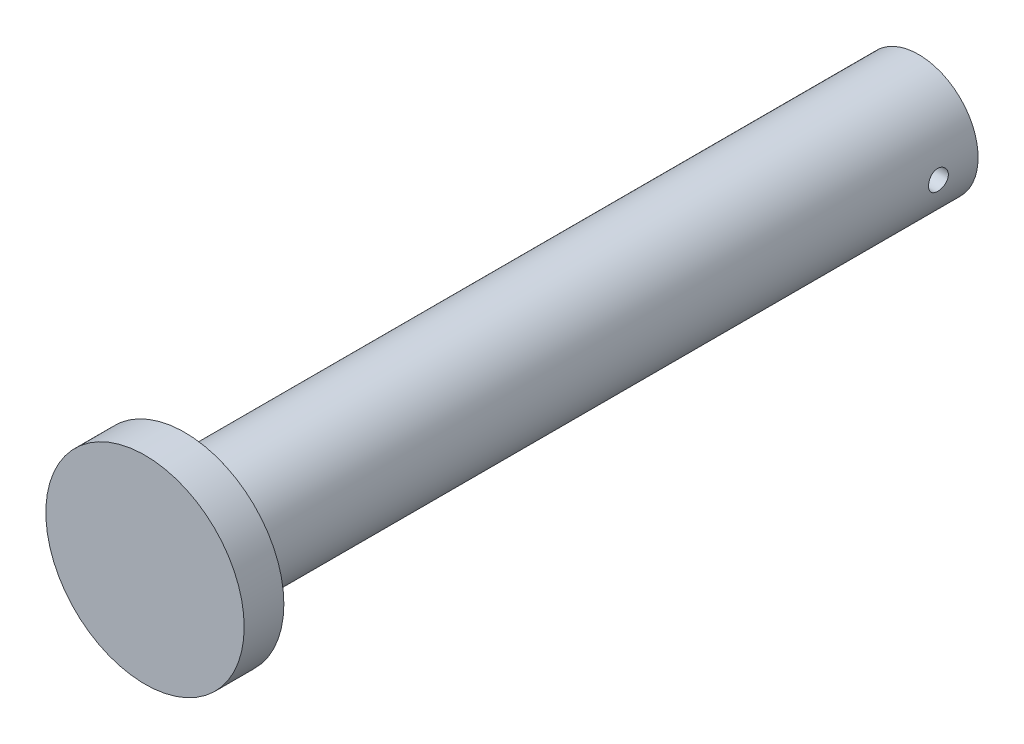
ISO-10303-21;
HEADER;
FILE_DESCRIPTION(('STEP AP214'),'2;1');
FILE_NAME('part.step','',(''),(''),'','','');
FILE_SCHEMA(('AUTOMOTIVE_DESIGN { 1 0 10303 214 1 1 1 1 }'));
ENDSEC;
DATA;
#1=APPLICATION_CONTEXT('core data for automotive mechanical design processes');
#2=APPLICATION_PROTOCOL_DEFINITION('international standard','automotive_design',2000,#1);
#3=PRODUCT_CONTEXT('',#1,'mechanical');
#4=PRODUCT('Part','Part','',(#3));
#5=PRODUCT_RELATED_PRODUCT_CATEGORY('part','',(#4));
#6=PRODUCT_DEFINITION_FORMATION('','',#4);
#7=PRODUCT_DEFINITION_CONTEXT('part definition',#1,'design');
#8=PRODUCT_DEFINITION('design','',#6,#7);
#9=PRODUCT_DEFINITION_SHAPE('','',#8);
#10=(LENGTH_UNIT() NAMED_UNIT(*) SI_UNIT(.MILLI.,.METRE.));
#11=(NAMED_UNIT(*) PLANE_ANGLE_UNIT() SI_UNIT($,.RADIAN.));
#12=(NAMED_UNIT(*) SI_UNIT($,.STERADIAN.) SOLID_ANGLE_UNIT());
#13=UNCERTAINTY_MEASURE_WITH_UNIT(LENGTH_MEASURE(1.E-05),#10,'distance_accuracy_value','');
#14=(GEOMETRIC_REPRESENTATION_CONTEXT(3) GLOBAL_UNCERTAINTY_ASSIGNED_CONTEXT((#13)) GLOBAL_UNIT_ASSIGNED_CONTEXT((#10,
#11,#12)) REPRESENTATION_CONTEXT('',''));
#15=CARTESIAN_POINT('',(0.,0.,0.));
#16=DIRECTION('',(0.,0.,1.));
#17=DIRECTION('',(1.,0.,0.));
#18=AXIS2_PLACEMENT_3D('',#15,#16,#17);
#19=CARTESIAN_POINT('',(0.,0.,10.));
#20=DIRECTION('',(0.,0.,-1.));
#21=DIRECTION('',(-1.,0.,0.));
#22=AXIS2_PLACEMENT_3D('',#19,#20,#21);
#23=CYLINDRICAL_SURFACE('',#22,25.);
#24=CARTESIAN_POINT('',(0.,0.,10.));
#25=DIRECTION('',(0.,0.,1.));
#26=DIRECTION('',(1.,0.,0.));
#27=AXIS2_PLACEMENT_3D('',#24,#25,#26);
#28=CIRCLE('',#27,25.);
#29=CARTESIAN_POINT('',(25.,0.,10.));
#30=VERTEX_POINT('',#29);
#31=EDGE_CURVE('E43',#30,#30,#28,.T.);
#32=ORIENTED_EDGE('',*,*,#31,.F.);
#33=EDGE_LOOP('',(#32));
#34=FACE_BOUND('',#33,.T.);
#35=CARTESIAN_POINT('',(0.,0.,0.));
#36=DIRECTION('',(0.,0.,1.));
#37=DIRECTION('',(1.,0.,0.));
#38=AXIS2_PLACEMENT_3D('',#35,#36,#37);
#39=CIRCLE('',#38,25.);
#40=CARTESIAN_POINT('',(25.,0.,0.));
#41=VERTEX_POINT('',#40);
#42=EDGE_CURVE('E48',#41,#41,#39,.T.);
#43=ORIENTED_EDGE('',*,*,#42,.T.);
#44=EDGE_LOOP('',(#43));
#45=FACE_BOUND('',#44,.T.);
#46=ADVANCED_FACE('F31',(#34,#45),#23,.T.);
#47=CARTESIAN_POINT('',(0.,0.,10.));
#48=DIRECTION('',(0.,0.,1.));
#49=DIRECTION('',(1.,0.,0.));
#50=AXIS2_PLACEMENT_3D('',#47,#48,#49);
#51=PLANE('',#50);
#52=ORIENTED_EDGE('',*,*,#31,.T.);
#53=EDGE_LOOP('',(#52));
#54=FACE_BOUND('',#53,.T.);
#55=ADVANCED_FACE('F78',(#54),#51,.T.);
#56=CARTESIAN_POINT('',(0.,0.,0.));
#57=DIRECTION('',(0.,0.,1.));
#58=DIRECTION('',(1.,0.,0.));
#59=AXIS2_PLACEMENT_3D('',#56,#57,#58);
#60=PLANE('',#59);
#61=CARTESIAN_POINT('',(0.,0.,0.));
#62=DIRECTION('',(0.,0.,-1.));
#63=DIRECTION('',(-1.,0.,0.));
#64=AXIS2_PLACEMENT_3D('',#61,#62,#63);
#65=CIRCLE('',#64,15.);
#66=CARTESIAN_POINT('',(-15.,0.,0.));
#67=VERTEX_POINT('',#66);
#68=EDGE_CURVE('E10',#67,#67,#65,.T.);
#69=ORIENTED_EDGE('',*,*,#68,.F.);
#70=EDGE_LOOP('',(#69));
#71=FACE_BOUND('',#70,.T.);
#72=ORIENTED_EDGE('',*,*,#42,.F.);
#73=EDGE_LOOP('',(#72));
#74=FACE_BOUND('',#73,.T.);
#75=ADVANCED_FACE('F74',(#71,#74),#60,.F.);
#76=CARTESIAN_POINT('',(0.,0.,-185.));
#77=DIRECTION('',(0.,0.,1.));
#78=DIRECTION('',(1.,0.,0.));
#79=AXIS2_PLACEMENT_3D('',#76,#77,#78);
#80=CYLINDRICAL_SURFACE('',#79,15.);
#81=CARTESIAN_POINT('',(15.,0.,-177.5));
#82=CARTESIAN_POINT('',(14.9999976116882,-0.139390904958215,-177.499994411052));
#83=CARTESIAN_POINT('',(14.9980367791303,-0.27885788183882,-177.488302725031));
#84=CARTESIAN_POINT('',(14.9904034494139,-0.553880221673042,-177.441864341235));
#85=CARTESIAN_POINT('',(14.9847275392389,-0.689431867959246,-177.407096443088));
#86=CARTESIAN_POINT('',(14.9703006823645,-0.952604747212646,-177.315584551407));
#87=CARTESIAN_POINT('',(14.9615522515919,-1.0802323684319,-177.258858534359));
#88=CARTESIAN_POINT('',(14.9419422708207,-1.32414184197795,-177.125087707948));
#89=CARTESIAN_POINT('',(14.9310809625443,-1.44042498987859,-177.048045222517));
#90=CARTESIAN_POINT('',(14.9083331745831,-1.65947261429168,-176.87504491618));
#91=CARTESIAN_POINT('',(14.8964387181486,-1.76211290353497,-176.778930885364));
#92=CARTESIAN_POINT('',(14.8730262687673,-1.94988849865993,-176.570852031527));
#93=CARTESIAN_POINT('',(14.8615082996267,-2.03502269939097,-176.458886208543));
#94=CARTESIAN_POINT('',(14.8400756575978,-2.18586712560513,-176.221429033803));
#95=CARTESIAN_POINT('',(14.8301712909164,-2.251454552861,-176.095858663195));
#96=CARTESIAN_POINT('',(14.8131978979467,-2.36055836541122,-175.835290435699));
#97=CARTESIAN_POINT('',(14.8061286801431,-2.40407624156561,-175.700293216322));
#98=CARTESIAN_POINT('',(14.7957053684276,-2.4674143777848,-175.426019725143));
#99=CARTESIAN_POINT('',(14.792317684857,-2.4874490291354,-175.286794263499));
#100=CARTESIAN_POINT('',(14.7895393893665,-2.50391672528987,-175.006919723116));
#101=CARTESIAN_POINT('',(14.7901484945721,-2.50035144038899,-174.866270745833));
#102=CARTESIAN_POINT('',(14.7952642886356,-2.46989509839614,-174.589072138725));
#103=CARTESIAN_POINT('',(14.7997307331892,-2.44324488188976,-174.452495196455));
#104=CARTESIAN_POINT('',(14.8119949521101,-2.36775314040344,-174.185778682171));
#105=CARTESIAN_POINT('',(14.8197928407327,-2.31891085431974,-174.055639331111));
#106=CARTESIAN_POINT('',(14.837884793341,-2.20017724609391,-173.804771176559));
#107=CARTESIAN_POINT('',(14.8481906710733,-2.1301859138797,-173.684090593919));
#108=CARTESIAN_POINT('',(14.8701291841501,-1.97121201755742,-173.456095599462));
#109=CARTESIAN_POINT('',(14.8817619265429,-1.88222792065428,-173.348782267545));
#110=CARTESIAN_POINT('',(14.9052202787979,-1.68648221215905,-173.149173914193));
#111=CARTESIAN_POINT('',(14.9170464923165,-1.57951396387313,-173.05708148146));
#112=CARTESIAN_POINT('',(14.9394260139672,-1.35153524898166,-172.892122237335));
#113=CARTESIAN_POINT('',(14.9499793138974,-1.23052469190643,-172.819255549817));
#114=CARTESIAN_POINT('',(14.9686389289291,-0.977705916166724,-172.694797772864));
#115=CARTESIAN_POINT('',(14.9767431840745,-0.845888725564671,-172.643224580669));
#116=CARTESIAN_POINT('',(14.9895750301266,-0.575298345602738,-172.563005784754));
#117=CARTESIAN_POINT('',(14.9943029035047,-0.436525739179473,-172.534358263026));
#118=CARTESIAN_POINT('',(14.9998112984269,-0.157709901301627,-172.501078641539));
#119=CARTESIAN_POINT('',(15.0006375301278,-0.017700737151013,-172.496168428194));
#120=CARTESIAN_POINT('',(14.9983747442117,0.261139772889888,-172.509761344428));
#121=CARTESIAN_POINT('',(14.9952858772412,0.39997116389204,-172.528263573134));
#122=CARTESIAN_POINT('',(14.985568269382,0.671656175546766,-172.587924849336));
#123=CARTESIAN_POINT('',(14.9789610480131,0.804540868385382,-172.62894620839));
#124=CARTESIAN_POINT('',(14.9629446445536,1.06154688486045,-172.7323345182));
#125=CARTESIAN_POINT('',(14.9535353051202,1.18566771590972,-172.794702667635));
#126=CARTESIAN_POINT('',(14.9328451630241,1.42283068946896,-172.939651124697));
#127=CARTESIAN_POINT('',(14.9215485588702,1.53576525093714,-173.022405156167));
#128=CARTESIAN_POINT('',(14.898384673919,1.74624358550268,-173.205537315385));
#129=CARTESIAN_POINT('',(14.8865173517155,1.84378623969658,-173.305916723277));
#130=CARTESIAN_POINT('',(14.8634017523585,2.021742779658,-173.522697548071));
#131=CARTESIAN_POINT('',(14.8521611613711,2.10196876111372,-173.639254165514));
#132=CARTESIAN_POINT('',(14.8317152977788,2.24170231029499,-173.884352969139));
#133=CARTESIAN_POINT('',(14.8225099606602,2.30121053476982,-174.012894775227));
#134=CARTESIAN_POINT('',(14.807234536977,2.39753833147315,-174.277789732812));
#135=CARTESIAN_POINT('',(14.8011515431106,2.43445143254794,-174.41410809503));
#136=CARTESIAN_POINT('',(14.7927771683526,2.48483545377827,-174.691120129222));
#137=CARTESIAN_POINT('',(14.7904854578272,2.49830841194616,-174.831813419732));
#138=CARTESIAN_POINT('',(14.7899673308401,2.50137286604735,-175.111705165962));
#139=CARTESIAN_POINT('',(14.7916905650565,2.49126013612518,-175.250900378575));
#140=CARTESIAN_POINT('',(14.7988978145373,2.44807983895684,-175.525579248051));
#141=CARTESIAN_POINT('',(14.8043818176121,2.41501234611247,-175.661062916942));
#142=CARTESIAN_POINT('',(14.8184735628172,2.32697448959489,-175.924358437293));
#143=CARTESIAN_POINT('',(14.8270776721967,2.27202959060043,-176.052179010056));
#144=CARTESIAN_POINT('',(14.8464436892221,2.14182700391589,-176.296835669195));
#145=CARTESIAN_POINT('',(14.857205703884,2.06656830874855,-176.413671210372));
#146=CARTESIAN_POINT('',(14.8798345404562,1.89681888437215,-176.634535583108));
#147=CARTESIAN_POINT('',(14.891712955763,1.80211056359364,-176.7383960167));
#148=CARTESIAN_POINT('',(14.9151437236084,1.59660903138023,-176.928851604475));
#149=CARTESIAN_POINT('',(14.9266960002655,1.48581211291264,-177.015442768638));
#150=CARTESIAN_POINT('',(14.9482652964222,1.25036916964029,-177.1694482682));
#151=CARTESIAN_POINT('',(14.958271162531,1.12563278753283,-177.236726039313));
#152=CARTESIAN_POINT('',(14.9755116760178,0.866513069378989,-177.34926948461));
#153=CARTESIAN_POINT('',(14.9827490817748,0.732139494830016,-177.39455708108));
#154=CARTESIAN_POINT('',(14.9920579083296,0.497703310045405,-177.452005274127));
#155=CARTESIAN_POINT('',(14.9950202727336,0.399058830298451,-177.469974469616));
#156=CARTESIAN_POINT('',(14.9989921598612,0.200289310319811,-177.493973737845));
#157=CARTESIAN_POINT('',(15.0000017162064,0.100164295608495,-177.500004016137));
#158=CARTESIAN_POINT('',(15.,0.,-177.5));
#159=B_SPLINE_CURVE_WITH_KNOTS('',3,(#81,#82,#83,#84,#85,#86,#87,#88,#89,#90,#91,#92,#93,#94,
#95,#96,#97,#98,#99,#100,#101,#102,#103,#104,#105,#106,#107,#108,#109,#110,#111,#112,#113,#114,
#115,#116,#117,#118,#119,#120,#121,#122,#123,#124,#125,#126,#127,#128,#129,#130,#131,#132,#133,
#134,#135,#136,#137,#138,#139,#140,#141,#142,#143,#144,#145,#146,#147,#148,#149,#150,#151,#152,
#153,#154,#155,#156,#157,#158),.UNSPECIFIED.,.T.,.F.,(4,2,2,2,2,2,2,2,2,2,2,2,2,2,2,2,2,2,2,2,2,
2,2,2,2,2,2,2,2,2,2,2,2,2,2,2,2,2,4),(0.,0.41780658493851,0.835997545695419,1.25384686702528,
1.67164841267479,2.09302491062332,2.51442800169857,2.9384252082384,3.36239376876182,
3.78246077103425,4.20249804320888,4.6182052176041,5.03392665025382,5.45164556632558,
5.86939820680574,6.29232769911325,6.71525991635845,7.13854688915901,7.56179844521148,
7.98007883491396,8.39834313035859,8.81407807006416,9.22983635826066,9.64926825627021,
10.0687306305428,10.4925382200762,10.9163323737594,11.3383602234177,11.7603513778662,
12.177079095227,12.5938054618813,13.0100481822622,13.4263115502934,13.8475138419339,
14.2688133387897,14.693022316072,15.1168075213007,15.4170424816402,15.7172722727697),.UNSPECIFIED.);
#160=CARTESIAN_POINT('',(15.,0.,-177.5));
#161=VERTEX_POINT('',#160);
#162=EDGE_CURVE('E34',#161,#161,#159,.T.);
#163=ORIENTED_EDGE('',*,*,#162,.T.);
#164=EDGE_LOOP('',(#163));
#165=FACE_BOUND('',#164,.T.);
#166=CARTESIAN_POINT('',(-15.,0.,-177.5));
#167=CARTESIAN_POINT('',(-14.9999976116882,0.139390904958215,-177.499994411052));
#168=CARTESIAN_POINT('',(-14.9980367791303,0.27885788183882,-177.488302725031));
#169=CARTESIAN_POINT('',(-14.9904034494139,0.553880221673042,-177.441864341235));
#170=CARTESIAN_POINT('',(-14.9847275392389,0.689431867959246,-177.407096443088));
#171=CARTESIAN_POINT('',(-14.9703006823645,0.952604747212646,-177.315584551407));
#172=CARTESIAN_POINT('',(-14.9615522515919,1.0802323684319,-177.258858534359));
#173=CARTESIAN_POINT('',(-14.9419422708207,1.32414184197795,-177.125087707948));
#174=CARTESIAN_POINT('',(-14.9310809625443,1.44042498987859,-177.048045222517));
#175=CARTESIAN_POINT('',(-14.9083331745831,1.65947261429168,-176.87504491618));
#176=CARTESIAN_POINT('',(-14.8964387181486,1.76211290353497,-176.778930885364));
#177=CARTESIAN_POINT('',(-14.8730262687673,1.94988849865993,-176.570852031527));
#178=CARTESIAN_POINT('',(-14.8615082996267,2.03502269939097,-176.458886208543));
#179=CARTESIAN_POINT('',(-14.8400756575978,2.18586712560513,-176.221429033803));
#180=CARTESIAN_POINT('',(-14.8301712909164,2.251454552861,-176.095858663195));
#181=CARTESIAN_POINT('',(-14.8131978979467,2.36055836541122,-175.835290435699));
#182=CARTESIAN_POINT('',(-14.8061286801431,2.40407624156561,-175.700293216322));
#183=CARTESIAN_POINT('',(-14.7957053684276,2.4674143777848,-175.426019725143));
#184=CARTESIAN_POINT('',(-14.792317684857,2.4874490291354,-175.286794263499));
#185=CARTESIAN_POINT('',(-14.7895393893665,2.50391672528987,-175.006919723116));
#186=CARTESIAN_POINT('',(-14.7901484945721,2.50035144038899,-174.866270745833));
#187=CARTESIAN_POINT('',(-14.7952642886356,2.46989509839614,-174.589072138725));
#188=CARTESIAN_POINT('',(-14.7997307331892,2.44324488188976,-174.452495196455));
#189=CARTESIAN_POINT('',(-14.8119949521101,2.36775314040344,-174.185778682171));
#190=CARTESIAN_POINT('',(-14.8197928407327,2.31891085431974,-174.055639331111));
#191=CARTESIAN_POINT('',(-14.837884793341,2.20017724609391,-173.804771176559));
#192=CARTESIAN_POINT('',(-14.8481906710733,2.1301859138797,-173.684090593919));
#193=CARTESIAN_POINT('',(-14.8701291841501,1.97121201755742,-173.456095599462));
#194=CARTESIAN_POINT('',(-14.8817619265429,1.88222792065428,-173.348782267545));
#195=CARTESIAN_POINT('',(-14.9052202787979,1.68648221215905,-173.149173914193));
#196=CARTESIAN_POINT('',(-14.9170464923165,1.57951396387313,-173.05708148146));
#197=CARTESIAN_POINT('',(-14.9394260139672,1.35153524898166,-172.892122237335));
#198=CARTESIAN_POINT('',(-14.9499793138974,1.23052469190643,-172.819255549817));
#199=CARTESIAN_POINT('',(-14.9686389289291,0.977705916166724,-172.694797772864));
#200=CARTESIAN_POINT('',(-14.9767431840745,0.845888725564671,-172.643224580669));
#201=CARTESIAN_POINT('',(-14.9895750301266,0.575298345602738,-172.563005784754));
#202=CARTESIAN_POINT('',(-14.9943029035047,0.436525739179473,-172.534358263026));
#203=CARTESIAN_POINT('',(-14.9998112984269,0.157709901301627,-172.501078641539));
#204=CARTESIAN_POINT('',(-15.0006375301278,0.017700737151013,-172.496168428194));
#205=CARTESIAN_POINT('',(-14.9983747442117,-0.261139772889888,-172.509761344428));
#206=CARTESIAN_POINT('',(-14.9952858772412,-0.39997116389204,-172.528263573134));
#207=CARTESIAN_POINT('',(-14.985568269382,-0.671656175546766,-172.587924849336));
#208=CARTESIAN_POINT('',(-14.9789610480131,-0.804540868385382,-172.62894620839));
#209=CARTESIAN_POINT('',(-14.9629446445536,-1.06154688486045,-172.7323345182));
#210=CARTESIAN_POINT('',(-14.9535353051202,-1.18566771590972,-172.794702667635));
#211=CARTESIAN_POINT('',(-14.9328451630241,-1.42283068946896,-172.939651124697));
#212=CARTESIAN_POINT('',(-14.9215485588702,-1.53576525093714,-173.022405156167));
#213=CARTESIAN_POINT('',(-14.898384673919,-1.74624358550268,-173.205537315385));
#214=CARTESIAN_POINT('',(-14.8865173517155,-1.84378623969658,-173.305916723277));
#215=CARTESIAN_POINT('',(-14.8634017523585,-2.021742779658,-173.522697548071));
#216=CARTESIAN_POINT('',(-14.8521611613711,-2.10196876111372,-173.639254165514));
#217=CARTESIAN_POINT('',(-14.8317152977788,-2.24170231029499,-173.884352969139));
#218=CARTESIAN_POINT('',(-14.8225099606602,-2.30121053476982,-174.012894775227));
#219=CARTESIAN_POINT('',(-14.807234536977,-2.39753833147315,-174.277789732812));
#220=CARTESIAN_POINT('',(-14.8011515431106,-2.43445143254794,-174.41410809503));
#221=CARTESIAN_POINT('',(-14.7927771683526,-2.48483545377827,-174.691120129222));
#222=CARTESIAN_POINT('',(-14.7904854578272,-2.49830841194616,-174.831813419732));
#223=CARTESIAN_POINT('',(-14.7899673308401,-2.50137286604735,-175.111705165962));
#224=CARTESIAN_POINT('',(-14.7916905650565,-2.49126013612518,-175.250900378575));
#225=CARTESIAN_POINT('',(-14.7988978145373,-2.44807983895684,-175.525579248051));
#226=CARTESIAN_POINT('',(-14.8043818176121,-2.41501234611247,-175.661062916942));
#227=CARTESIAN_POINT('',(-14.8184735628172,-2.32697448959489,-175.924358437293));
#228=CARTESIAN_POINT('',(-14.8270776721967,-2.27202959060043,-176.052179010056));
#229=CARTESIAN_POINT('',(-14.8464436892221,-2.14182700391589,-176.296835669195));
#230=CARTESIAN_POINT('',(-14.857205703884,-2.06656830874855,-176.413671210372));
#231=CARTESIAN_POINT('',(-14.8798345404562,-1.89681888437215,-176.634535583108));
#232=CARTESIAN_POINT('',(-14.891712955763,-1.80211056359364,-176.7383960167));
#233=CARTESIAN_POINT('',(-14.9151437236084,-1.59660903138023,-176.928851604475));
#234=CARTESIAN_POINT('',(-14.9266960002655,-1.48581211291264,-177.015442768638));
#235=CARTESIAN_POINT('',(-14.9482652964222,-1.25036916964029,-177.1694482682));
#236=CARTESIAN_POINT('',(-14.958271162531,-1.12563278753283,-177.236726039313));
#237=CARTESIAN_POINT('',(-14.9755116760178,-0.866513069378989,-177.34926948461));
#238=CARTESIAN_POINT('',(-14.9827490817748,-0.732139494830016,-177.39455708108));
#239=CARTESIAN_POINT('',(-14.9920579083296,-0.497703310045405,-177.452005274127));
#240=CARTESIAN_POINT('',(-14.9950202727336,-0.399058830298451,-177.469974469616));
#241=CARTESIAN_POINT('',(-14.9989921598612,-0.200289310319811,-177.493973737845));
#242=CARTESIAN_POINT('',(-15.0000017162064,-0.100164295608495,-177.500004016137));
#243=CARTESIAN_POINT('',(-15.,0.,-177.5));
#244=B_SPLINE_CURVE_WITH_KNOTS('',3,(#166,#167,#168,#169,#170,#171,#172,#173,#174,#175,#176,
#177,#178,#179,#180,#181,#182,#183,#184,#185,#186,#187,#188,#189,#190,#191,#192,#193,#194,#195,
#196,#197,#198,#199,#200,#201,#202,#203,#204,#205,#206,#207,#208,#209,#210,#211,#212,#213,#214,
#215,#216,#217,#218,#219,#220,#221,#222,#223,#224,#225,#226,#227,#228,#229,#230,#231,#232,#233,
#234,#235,#236,#237,#238,#239,#240,#241,#242,#243),.UNSPECIFIED.,.T.,.F.,(4,2,2,2,2,2,2,2,2,2,2,
2,2,2,2,2,2,2,2,2,2,2,2,2,2,2,2,2,2,2,2,2,2,2,2,2,2,2,4),(0.,0.41780658493851,0.835997545695419,
1.25384686702528,1.67164841267479,2.09302491062332,2.51442800169857,2.9384252082384,
3.36239376876182,3.78246077103425,4.20249804320888,4.6182052176041,5.03392665025382,
5.45164556632558,5.86939820680574,6.29232769911325,6.71525991635845,7.13854688915901,
7.56179844521148,7.98007883491396,8.39834313035859,8.81407807006416,9.22983635826066,
9.64926825627021,10.0687306305428,10.4925382200762,10.9163323737594,11.3383602234177,
11.7603513778662,12.177079095227,12.5938054618813,13.0100481822622,13.4263115502934,
13.8475138419339,14.2688133387897,14.693022316072,15.1168075213007,15.4170424816402,
15.7172722727697),.UNSPECIFIED.);
#245=CARTESIAN_POINT('',(-15.,0.,-177.5));
#246=VERTEX_POINT('',#245);
#247=EDGE_CURVE('E54',#246,#246,#244,.T.);
#248=ORIENTED_EDGE('',*,*,#247,.T.);
#249=EDGE_LOOP('',(#248));
#250=FACE_BOUND('',#249,.T.);
#251=CARTESIAN_POINT('',(0.,0.,-185.));
#252=DIRECTION('',(0.,0.,-1.));
#253=DIRECTION('',(-1.,0.,0.));
#254=AXIS2_PLACEMENT_3D('',#251,#252,#253);
#255=CIRCLE('',#254,15.);
#256=CARTESIAN_POINT('',(-15.,0.,-185.));
#257=VERTEX_POINT('',#256);
#258=EDGE_CURVE('E51',#257,#257,#255,.T.);
#259=ORIENTED_EDGE('',*,*,#258,.F.);
#260=EDGE_LOOP('',(#259));
#261=FACE_BOUND('',#260,.T.);
#262=ORIENTED_EDGE('',*,*,#68,.T.);
#263=EDGE_LOOP('',(#262));
#264=FACE_BOUND('',#263,.T.);
#265=ADVANCED_FACE('F59',(#165,#250,#261,#264),#80,.T.);
#266=CARTESIAN_POINT('',(0.,0.,-185.));
#267=DIRECTION('',(0.,0.,-1.));
#268=DIRECTION('',(-1.,0.,0.));
#269=AXIS2_PLACEMENT_3D('',#266,#267,#268);
#270=PLANE('',#269);
#271=ORIENTED_EDGE('',*,*,#258,.T.);
#272=EDGE_LOOP('',(#271));
#273=FACE_BOUND('',#272,.T.);
#274=ADVANCED_FACE('F66',(#273),#270,.T.);
#275=CARTESIAN_POINT('',(-92.5,0.,-175.));
#276=DIRECTION('',(1.,0.,0.));
#277=DIRECTION('',(0.,0.,-1.));
#278=AXIS2_PLACEMENT_3D('',#275,#276,#277);
#279=CYLINDRICAL_SURFACE('',#278,2.5);
#280=ORIENTED_EDGE('',*,*,#247,.F.);
#281=EDGE_LOOP('',(#280));
#282=FACE_BOUND('',#281,.T.);
#283=ORIENTED_EDGE('',*,*,#162,.F.);
#284=EDGE_LOOP('',(#283));
#285=FACE_BOUND('',#284,.T.);
#286=ADVANCED_FACE('F63',(#282,#285),#279,.F.);
#287=CLOSED_SHELL('',(#46,#55,#75,#265,#274,#286));
#288=MANIFOLD_SOLID_BREP('B2',#287);
#289=ADVANCED_BREP_SHAPE_REPRESENTATION('',(#18,#288),#14);
#290=SHAPE_DEFINITION_REPRESENTATION(#9,#289);
ENDSEC;
END-ISO-10303-21;
